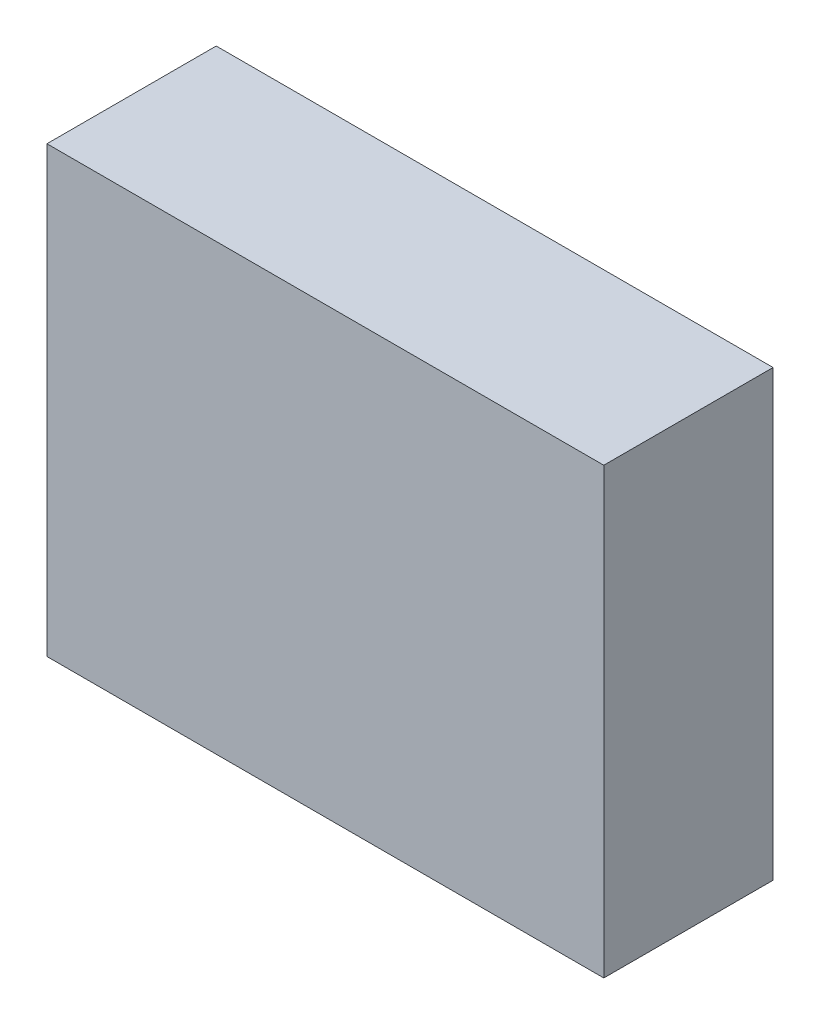
ISO-10303-21;
HEADER;
FILE_DESCRIPTION(('STEP AP214'),'2;1');
FILE_NAME('part.step','',(''),(''),'','','');
FILE_SCHEMA(('AUTOMOTIVE_DESIGN { 1 0 10303 214 1 1 1 1 }'));
ENDSEC;
DATA;
#1=APPLICATION_CONTEXT('core data for automotive mechanical design processes');
#2=APPLICATION_PROTOCOL_DEFINITION('international standard','automotive_design',2000,#1);
#3=PRODUCT_CONTEXT('',#1,'mechanical');
#4=PRODUCT('Part','Part','',(#3));
#5=PRODUCT_RELATED_PRODUCT_CATEGORY('part','',(#4));
#6=PRODUCT_DEFINITION_FORMATION('','',#4);
#7=PRODUCT_DEFINITION_CONTEXT('part definition',#1,'design');
#8=PRODUCT_DEFINITION('design','',#6,#7);
#9=PRODUCT_DEFINITION_SHAPE('','',#8);
#10=(LENGTH_UNIT() NAMED_UNIT(*) SI_UNIT(.MILLI.,.METRE.));
#11=(NAMED_UNIT(*) PLANE_ANGLE_UNIT() SI_UNIT($,.RADIAN.));
#12=(NAMED_UNIT(*) SI_UNIT($,.STERADIAN.) SOLID_ANGLE_UNIT());
#13=UNCERTAINTY_MEASURE_WITH_UNIT(LENGTH_MEASURE(1.E-05),#10,'distance_accuracy_value','');
#14=(GEOMETRIC_REPRESENTATION_CONTEXT(3) GLOBAL_UNCERTAINTY_ASSIGNED_CONTEXT((#13)) GLOBAL_UNIT_ASSIGNED_CONTEXT((#10,
#11,#12)) REPRESENTATION_CONTEXT('',''));
#15=CARTESIAN_POINT('',(0.,0.,0.));
#16=DIRECTION('',(0.,0.,1.));
#17=DIRECTION('',(1.,0.,0.));
#18=AXIS2_PLACEMENT_3D('',#15,#16,#17);
#19=CARTESIAN_POINT('',(-1.0033,-0.8001,0.));
#20=DIRECTION('',(0.,0.,-1.));
#21=DIRECTION('',(-1.,0.,0.));
#22=AXIS2_PLACEMENT_3D('',#19,#20,#21);
#23=PLANE('',#22);
#24=DIRECTION('',(0.,1.,0.));
#25=VECTOR('',#24,1.);
#26=CARTESIAN_POINT('',(-1.0033,0.8001,0.));
#27=LINE('',#26,#25);
#28=CARTESIAN_POINT('',(-1.0033,-0.8001,0.));
#29=VERTEX_POINT('',#28);
#30=CARTESIAN_POINT('',(-1.0033,0.8001,0.));
#31=VERTEX_POINT('',#30);
#32=EDGE_CURVE('E58',#29,#31,#27,.T.);
#33=ORIENTED_EDGE('',*,*,#32,.T.);
#34=DIRECTION('',(1.,0.,0.));
#35=VECTOR('',#34,1.);
#36=CARTESIAN_POINT('',(1.0033,0.8001,0.));
#37=LINE('',#36,#35);
#38=CARTESIAN_POINT('',(1.0033,0.8001,0.));
#39=VERTEX_POINT('',#38);
#40=EDGE_CURVE('E53',#31,#39,#37,.T.);
#41=ORIENTED_EDGE('',*,*,#40,.T.);
#42=DIRECTION('',(0.,1.,0.));
#43=VECTOR('',#42,1.);
#44=CARTESIAN_POINT('',(1.0033,-0.8001,0.));
#45=LINE('',#44,#43);
#46=CARTESIAN_POINT('',(1.0033,-0.8001,0.));
#47=VERTEX_POINT('',#46);
#48=EDGE_CURVE('E20',#39,#47,#45,.F.);
#49=ORIENTED_EDGE('',*,*,#48,.T.);
#50=DIRECTION('',(1.,0.,0.));
#51=VECTOR('',#50,1.);
#52=CARTESIAN_POINT('',(-1.0033,-0.8001,0.));
#53=LINE('',#52,#51);
#54=EDGE_CURVE('E67',#47,#29,#53,.F.);
#55=ORIENTED_EDGE('',*,*,#54,.T.);
#56=EDGE_LOOP('',(#33,#41,#49,#55));
#57=FACE_BOUND('',#56,.T.);
#58=ADVANCED_FACE('F17',(#57),#23,.T.);
#59=CARTESIAN_POINT('',(-1.0033,-0.8001,0.));
#60=DIRECTION('',(0.,1.,0.));
#61=DIRECTION('',(0.,0.,1.));
#62=AXIS2_PLACEMENT_3D('',#59,#60,#61);
#63=PLANE('',#62);
#64=DIRECTION('',(-1.,0.,0.));
#65=VECTOR('',#64,1.);
#66=CARTESIAN_POINT('',(-1.0033,-0.8001,0.61));
#67=LINE('',#66,#65);
#68=CARTESIAN_POINT('',(1.0033,-0.8001,0.61));
#69=VERTEX_POINT('',#68);
#70=CARTESIAN_POINT('',(-1.0033,-0.8001,0.61));
#71=VERTEX_POINT('',#70);
#72=EDGE_CURVE('E75',#69,#71,#67,.T.);
#73=ORIENTED_EDGE('',*,*,#72,.T.);
#74=DIRECTION('',(0.,0.,-1.));
#75=VECTOR('',#74,1.);
#76=CARTESIAN_POINT('',(-1.0033,-0.8001,0.));
#77=LINE('',#76,#75);
#78=EDGE_CURVE('E63',#71,#29,#77,.T.);
#79=ORIENTED_EDGE('',*,*,#78,.T.);
#80=ORIENTED_EDGE('',*,*,#54,.F.);
#81=DIRECTION('',(0.,0.,1.));
#82=VECTOR('',#81,1.);
#83=CARTESIAN_POINT('',(1.0033,-0.8001,0.));
#84=LINE('',#83,#82);
#85=EDGE_CURVE('E80',#47,#69,#84,.T.);
#86=ORIENTED_EDGE('',*,*,#85,.T.);
#87=EDGE_LOOP('',(#73,#79,#80,#86));
#88=FACE_BOUND('',#87,.T.);
#89=ADVANCED_FACE('F74',(#88),#63,.F.);
#90=CARTESIAN_POINT('',(-1.0033,0.8001,0.));
#91=DIRECTION('',(1.,0.,0.));
#92=DIRECTION('',(0.,0.,-1.));
#93=AXIS2_PLACEMENT_3D('',#90,#91,#92);
#94=PLANE('',#93);
#95=DIRECTION('',(0.,1.,0.));
#96=VECTOR('',#95,1.);
#97=CARTESIAN_POINT('',(-1.0033,-0.8001,0.61));
#98=LINE('',#97,#96);
#99=CARTESIAN_POINT('',(-1.0033,0.8001,0.61));
#100=VERTEX_POINT('',#99);
#101=EDGE_CURVE('E84',#71,#100,#98,.T.);
#102=ORIENTED_EDGE('',*,*,#101,.T.);
#103=DIRECTION('',(0.,0.,-1.));
#104=VECTOR('',#103,1.);
#105=CARTESIAN_POINT('',(-1.0033,0.8001,0.));
#106=LINE('',#105,#104);
#107=EDGE_CURVE('E65',#100,#31,#106,.T.);
#108=ORIENTED_EDGE('',*,*,#107,.T.);
#109=ORIENTED_EDGE('',*,*,#32,.F.);
#110=ORIENTED_EDGE('',*,*,#78,.F.);
#111=EDGE_LOOP('',(#102,#108,#109,#110));
#112=FACE_BOUND('',#111,.T.);
#113=ADVANCED_FACE('F61',(#112),#94,.F.);
#114=CARTESIAN_POINT('',(1.0033,0.8001,0.));
#115=DIRECTION('',(0.,-1.,0.));
#116=DIRECTION('',(0.,0.,-1.));
#117=AXIS2_PLACEMENT_3D('',#114,#115,#116);
#118=PLANE('',#117);
#119=DIRECTION('',(-1.,0.,0.));
#120=VECTOR('',#119,1.);
#121=CARTESIAN_POINT('',(-1.0033,0.8001,0.61));
#122=LINE('',#121,#120);
#123=CARTESIAN_POINT('',(1.0033,0.8001,0.61));
#124=VERTEX_POINT('',#123);
#125=EDGE_CURVE('E26',#100,#124,#122,.F.);
#126=ORIENTED_EDGE('',*,*,#125,.T.);
#127=DIRECTION('',(0.,0.,1.));
#128=VECTOR('',#127,1.);
#129=CARTESIAN_POINT('',(1.0033,0.8001,0.));
#130=LINE('',#129,#128);
#131=EDGE_CURVE('E34',#124,#39,#130,.F.);
#132=ORIENTED_EDGE('',*,*,#131,.T.);
#133=ORIENTED_EDGE('',*,*,#40,.F.);
#134=ORIENTED_EDGE('',*,*,#107,.F.);
#135=EDGE_LOOP('',(#126,#132,#133,#134));
#136=FACE_BOUND('',#135,.T.);
#137=ADVANCED_FACE('F88',(#136),#118,.F.);
#138=CARTESIAN_POINT('',(1.0033,-0.8001,0.));
#139=DIRECTION('',(-1.,0.,0.));
#140=DIRECTION('',(0.,0.,1.));
#141=AXIS2_PLACEMENT_3D('',#138,#139,#140);
#142=PLANE('',#141);
#143=DIRECTION('',(0.,1.,0.));
#144=VECTOR('',#143,1.);
#145=CARTESIAN_POINT('',(1.0033,-0.8001,0.61));
#146=LINE('',#145,#144);
#147=EDGE_CURVE('E11',#124,#69,#146,.F.);
#148=ORIENTED_EDGE('',*,*,#147,.T.);
#149=ORIENTED_EDGE('',*,*,#85,.F.);
#150=ORIENTED_EDGE('',*,*,#48,.F.);
#151=ORIENTED_EDGE('',*,*,#131,.F.);
#152=EDGE_LOOP('',(#148,#149,#150,#151));
#153=FACE_BOUND('',#152,.T.);
#154=ADVANCED_FACE('F91',(#153),#142,.F.);
#155=CARTESIAN_POINT('',(-1.0033,-0.8001,0.61));
#156=DIRECTION('',(0.,0.,-1.));
#157=DIRECTION('',(-1.,0.,0.));
#158=AXIS2_PLACEMENT_3D('',#155,#156,#157);
#159=PLANE('',#158);
#160=ORIENTED_EDGE('',*,*,#125,.F.);
#161=ORIENTED_EDGE('',*,*,#101,.F.);
#162=ORIENTED_EDGE('',*,*,#72,.F.);
#163=ORIENTED_EDGE('',*,*,#147,.F.);
#164=EDGE_LOOP('',(#160,#161,#162,#163));
#165=FACE_BOUND('',#164,.T.);
#166=ADVANCED_FACE('F90',(#165),#159,.F.);
#167=CLOSED_SHELL('',(#58,#89,#113,#137,#154,#166));
#168=MANIFOLD_SOLID_BREP('B1',#167);
#169=ADVANCED_BREP_SHAPE_REPRESENTATION('',(#18,#168),#14);
#170=SHAPE_DEFINITION_REPRESENTATION(#9,#169);
ENDSEC;
END-ISO-10303-21;
